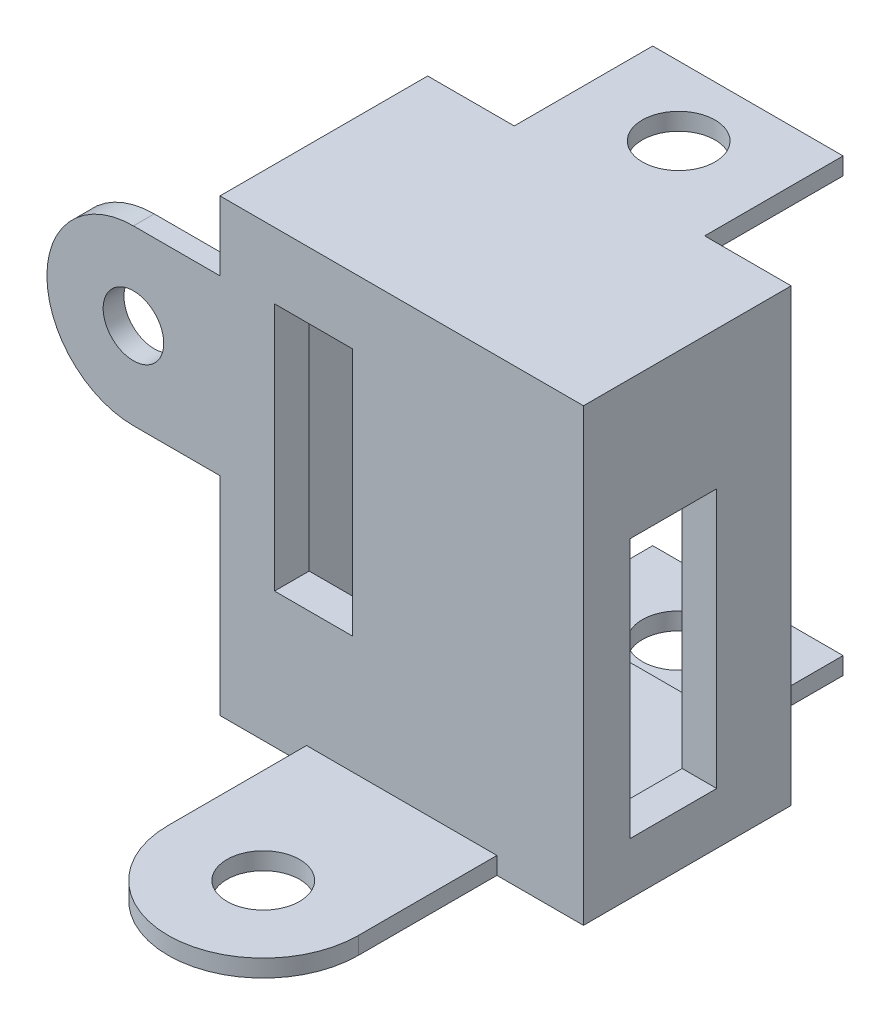
ISO-10303-21;
HEADER;
FILE_DESCRIPTION(('STEP AP214'),'2;1');
FILE_NAME('part.step','',(''),(''),'','','');
FILE_SCHEMA(('AUTOMOTIVE_DESIGN { 1 0 10303 214 1 1 1 1 }'));
ENDSEC;
DATA;
#1=APPLICATION_CONTEXT('core data for automotive mechanical design processes');
#2=APPLICATION_PROTOCOL_DEFINITION('international standard','automotive_design',2000,#1);
#3=PRODUCT_CONTEXT('',#1,'mechanical');
#4=PRODUCT('Part','Part','',(#3));
#5=PRODUCT_RELATED_PRODUCT_CATEGORY('part','',(#4));
#6=PRODUCT_DEFINITION_FORMATION('','',#4);
#7=PRODUCT_DEFINITION_CONTEXT('part definition',#1,'design');
#8=PRODUCT_DEFINITION('design','',#6,#7);
#9=PRODUCT_DEFINITION_SHAPE('','',#8);
#10=(LENGTH_UNIT() NAMED_UNIT(*) SI_UNIT(.MILLI.,.METRE.));
#11=(NAMED_UNIT(*) PLANE_ANGLE_UNIT() SI_UNIT($,.RADIAN.));
#12=(NAMED_UNIT(*) SI_UNIT($,.STERADIAN.) SOLID_ANGLE_UNIT());
#13=UNCERTAINTY_MEASURE_WITH_UNIT(LENGTH_MEASURE(1.E-05),#10,'distance_accuracy_value','');
#14=(GEOMETRIC_REPRESENTATION_CONTEXT(3) GLOBAL_UNCERTAINTY_ASSIGNED_CONTEXT((#13)) GLOBAL_UNIT_ASSIGNED_CONTEXT((#10,
#11,#12)) REPRESENTATION_CONTEXT('',''));
#15=CARTESIAN_POINT('',(0.,0.,0.));
#16=DIRECTION('',(0.,0.,1.));
#17=DIRECTION('',(1.,0.,0.));
#18=AXIS2_PLACEMENT_3D('',#15,#16,#17);
#19=CARTESIAN_POINT('',(0.,0.,12.));
#20=DIRECTION('',(0.,0.,-1.));
#21=DIRECTION('',(-1.,0.,0.));
#22=AXIS2_PLACEMENT_3D('',#19,#20,#21);
#23=PLANE('',#22);
#24=DIRECTION('',(1.,0.,0.));
#25=VECTOR('',#24,1.);
#26=CARTESIAN_POINT('',(0.,9.17624256455344,12.));
#27=LINE('',#26,#25);
#28=CARTESIAN_POINT('',(-7.34922345286043,9.17624256455344,12.));
#29=VERTEX_POINT('',#28);
#30=CARTESIAN_POINT('',(-2.85081475530487,9.17624256455344,12.));
#31=VERTEX_POINT('',#30);
#32=EDGE_CURVE('E279',#29,#31,#27,.T.);
#33=ORIENTED_EDGE('',*,*,#32,.T.);
#34=DIRECTION('',(0.,-1.,0.));
#35=VECTOR('',#34,1.);
#36=CARTESIAN_POINT('',(-2.85081475530487,0.,12.));
#37=LINE('',#36,#35);
#38=CARTESIAN_POINT('',(-2.85081475530487,-5.19672181056315,12.));
#39=VERTEX_POINT('',#38);
#40=EDGE_CURVE('E282',#31,#39,#37,.T.);
#41=ORIENTED_EDGE('',*,*,#40,.T.);
#42=DIRECTION('',(-1.,0.,0.));
#43=VECTOR('',#42,1.);
#44=CARTESIAN_POINT('',(0.,-5.19672181056315,12.));
#45=LINE('',#44,#43);
#46=CARTESIAN_POINT('',(-7.34922345286043,-5.19672181056315,12.));
#47=VERTEX_POINT('',#46);
#48=EDGE_CURVE('E274',#39,#47,#45,.T.);
#49=ORIENTED_EDGE('',*,*,#48,.T.);
#50=DIRECTION('',(0.,1.,0.));
#51=VECTOR('',#50,1.);
#52=CARTESIAN_POINT('',(-7.34922345286043,0.,12.));
#53=LINE('',#52,#51);
#54=EDGE_CURVE('E254',#47,#29,#53,.T.);
#55=ORIENTED_EDGE('',*,*,#54,.T.);
#56=EDGE_LOOP('',(#33,#41,#49,#55));
#57=FACE_BOUND('',#56,.T.);
#58=CARTESIAN_POINT('',(-15.5,4.,12.));
#59=DIRECTION('',(0.,0.,1.));
#60=DIRECTION('',(1.,0.,0.));
#61=AXIS2_PLACEMENT_3D('',#58,#59,#60);
#62=CIRCLE('',#61,1.75);
#63=CARTESIAN_POINT('',(-13.75,4.,12.));
#64=VERTEX_POINT('',#63);
#65=EDGE_CURVE('E315',#64,#64,#62,.T.);
#66=ORIENTED_EDGE('',*,*,#65,.F.);
#67=EDGE_LOOP('',(#66));
#68=FACE_BOUND('',#67,.T.);
#69=DIRECTION('',(0.,-1.,0.));
#70=VECTOR('',#69,1.);
#71=CARTESIAN_POINT('',(-5.5,-12.,12.));
#72=LINE('',#71,#70);
#73=CARTESIAN_POINT('',(-5.5,-12.,12.));
#74=VERTEX_POINT('',#73);
#75=CARTESIAN_POINT('',(-5.5,-13.,12.));
#76=VERTEX_POINT('',#75);
#77=EDGE_CURVE('E313',#74,#76,#72,.T.);
#78=ORIENTED_EDGE('',*,*,#77,.F.);
#79=DIRECTION('',(1.,0.,0.));
#80=VECTOR('',#79,1.);
#81=CARTESIAN_POINT('',(0.,-12.,12.));
#82=LINE('',#81,#80);
#83=CARTESIAN_POINT('',(5.5,-12.,12.));
#84=VERTEX_POINT('',#83);
#85=EDGE_CURVE('E292',#74,#84,#82,.T.);
#86=ORIENTED_EDGE('',*,*,#85,.T.);
#87=DIRECTION('',(0.,-1.,0.));
#88=VECTOR('',#87,1.);
#89=CARTESIAN_POINT('',(5.5,-12.,12.));
#90=LINE('',#89,#88);
#91=CARTESIAN_POINT('',(5.5,-13.,12.));
#92=VERTEX_POINT('',#91);
#93=EDGE_CURVE('E305',#84,#92,#90,.T.);
#94=ORIENTED_EDGE('',*,*,#93,.T.);
#95=DIRECTION('',(1.,0.,0.));
#96=VECTOR('',#95,1.);
#97=CARTESIAN_POINT('',(-10.5,-13.,12.));
#98=LINE('',#97,#96);
#99=CARTESIAN_POINT('',(10.5,-13.,12.));
#100=VERTEX_POINT('',#99);
#101=EDGE_CURVE('E459',#92,#100,#98,.T.);
#102=ORIENTED_EDGE('',*,*,#101,.T.);
#103=DIRECTION('',(0.,1.,0.));
#104=VECTOR('',#103,1.);
#105=CARTESIAN_POINT('',(10.5,-13.,12.));
#106=LINE('',#105,#104);
#107=CARTESIAN_POINT('',(10.5,13.,12.));
#108=VERTEX_POINT('',#107);
#109=EDGE_CURVE('E444',#100,#108,#106,.T.);
#110=ORIENTED_EDGE('',*,*,#109,.T.);
#111=DIRECTION('',(-1.,0.,0.));
#112=VECTOR('',#111,1.);
#113=CARTESIAN_POINT('',(-10.5,13.,12.));
#114=LINE('',#113,#112);
#115=CARTESIAN_POINT('',(-10.5,13.,12.));
#116=VERTEX_POINT('',#115);
#117=EDGE_CURVE('E453',#108,#116,#114,.T.);
#118=ORIENTED_EDGE('',*,*,#117,.T.);
#119=DIRECTION('',(0.,-1.,0.));
#120=VECTOR('',#119,1.);
#121=CARTESIAN_POINT('',(-10.5,-13.,12.));
#122=LINE('',#121,#120);
#123=CARTESIAN_POINT('',(-10.5,9.,12.));
#124=VERTEX_POINT('',#123);
#125=EDGE_CURVE('E456',#116,#124,#122,.T.);
#126=ORIENTED_EDGE('',*,*,#125,.T.);
#127=DIRECTION('',(-1.,0.,0.));
#128=VECTOR('',#127,1.);
#129=CARTESIAN_POINT('',(0.,9.,12.));
#130=LINE('',#129,#128);
#131=CARTESIAN_POINT('',(-15.5,9.,12.));
#132=VERTEX_POINT('',#131);
#133=EDGE_CURVE('E326',#124,#132,#130,.T.);
#134=ORIENTED_EDGE('',*,*,#133,.T.);
#135=CARTESIAN_POINT('',(-15.5,4.,12.));
#136=DIRECTION('',(0.,0.,1.));
#137=DIRECTION('',(1.,0.,0.));
#138=AXIS2_PLACEMENT_3D('',#135,#136,#137);
#139=CIRCLE('',#138,5.);
#140=CARTESIAN_POINT('',(-15.5,-1.,12.));
#141=VERTEX_POINT('',#140);
#142=EDGE_CURVE('E338',#141,#132,#139,.F.);
#143=ORIENTED_EDGE('',*,*,#142,.F.);
#144=DIRECTION('',(-1.,0.,0.));
#145=VECTOR('',#144,1.);
#146=CARTESIAN_POINT('',(0.,-1.,12.));
#147=LINE('',#146,#145);
#148=CARTESIAN_POINT('',(-10.5,-1.,12.));
#149=VERTEX_POINT('',#148);
#150=EDGE_CURVE('E341',#149,#141,#147,.T.);
#151=ORIENTED_EDGE('',*,*,#150,.F.);
#152=CARTESIAN_POINT('',(-10.5,-13.,12.));
#153=VERTEX_POINT('',#152);
#154=EDGE_CURVE('E455',#149,#153,#122,.T.);
#155=ORIENTED_EDGE('',*,*,#154,.T.);
#156=EDGE_CURVE('E460',#153,#76,#98,.T.);
#157=ORIENTED_EDGE('',*,*,#156,.T.);
#158=EDGE_LOOP('',(#78,#86,#94,#102,#110,#118,#126,#134,#143,#151,#155,#157));
#159=FACE_BOUND('',#158,.T.);
#160=ADVANCED_FACE('F38',(#57,#68,#159),#23,.F.);
#161=CARTESIAN_POINT('',(-10.5,-13.,10.));
#162=DIRECTION('',(1.,0.,0.));
#163=DIRECTION('',(0.,0.,-1.));
#164=AXIS2_PLACEMENT_3D('',#161,#162,#163);
#165=PLANE('',#164);
#166=DIRECTION('',(0.,0.,1.));
#167=VECTOR('',#166,1.);
#168=CARTESIAN_POINT('',(-10.5,-1.,10.8));
#169=LINE('',#168,#167);
#170=CARTESIAN_POINT('',(-10.5,-1.,10.8));
#171=VERTEX_POINT('',#170);
#172=EDGE_CURVE('E351',#171,#149,#169,.T.);
#173=ORIENTED_EDGE('',*,*,#172,.F.);
#174=DIRECTION('',(0.,-1.,0.));
#175=VECTOR('',#174,1.);
#176=CARTESIAN_POINT('',(-10.5,0.,10.8));
#177=LINE('',#176,#175);
#178=CARTESIAN_POINT('',(-10.5,9.,10.8));
#179=VERTEX_POINT('',#178);
#180=EDGE_CURVE('E330',#179,#171,#177,.T.);
#181=ORIENTED_EDGE('',*,*,#180,.F.);
#182=DIRECTION('',(0.,0.,1.));
#183=VECTOR('',#182,1.);
#184=CARTESIAN_POINT('',(-10.5,9.,10.8));
#185=LINE('',#184,#183);
#186=EDGE_CURVE('E348',#179,#124,#185,.T.);
#187=ORIENTED_EDGE('',*,*,#186,.T.);
#188=ORIENTED_EDGE('',*,*,#125,.F.);
#189=DIRECTION('',(0.,0.,-1.));
#190=VECTOR('',#189,1.);
#191=CARTESIAN_POINT('',(-10.5,13.,10.));
#192=LINE('',#191,#190);
#193=CARTESIAN_POINT('',(-10.5,13.,0.));
#194=VERTEX_POINT('',#193);
#195=EDGE_CURVE('E47',#116,#194,#192,.T.);
#196=ORIENTED_EDGE('',*,*,#195,.T.);
#197=DIRECTION('',(0.,-1.,0.));
#198=VECTOR('',#197,1.);
#199=CARTESIAN_POINT('',(-10.5,-13.,0.));
#200=LINE('',#199,#198);
#201=CARTESIAN_POINT('',(-10.5,-13.,0.));
#202=VERTEX_POINT('',#201);
#203=EDGE_CURVE('E504',#194,#202,#200,.T.);
#204=ORIENTED_EDGE('',*,*,#203,.T.);
#205=DIRECTION('',(0.,0.,-1.));
#206=VECTOR('',#205,1.);
#207=CARTESIAN_POINT('',(-10.5,-13.,10.));
#208=LINE('',#207,#206);
#209=EDGE_CURVE('E513',#153,#202,#208,.T.);
#210=ORIENTED_EDGE('',*,*,#209,.F.);
#211=ORIENTED_EDGE('',*,*,#154,.F.);
#212=EDGE_LOOP('',(#173,#181,#187,#188,#196,#204,#210,#211));
#213=FACE_BOUND('',#212,.T.);
#214=ADVANCED_FACE('F522',(#213),#165,.F.);
#215=CARTESIAN_POINT('',(0.,0.,0.));
#216=DIRECTION('',(0.,0.,-1.));
#217=DIRECTION('',(-1.,0.,0.));
#218=AXIS2_PLACEMENT_3D('',#215,#216,#217);
#219=PLANE('',#218);
#220=DIRECTION('',(1.,0.,0.));
#221=VECTOR('',#220,1.);
#222=CARTESIAN_POINT('',(-8.5,-10.5,0.));
#223=LINE('',#222,#221);
#224=CARTESIAN_POINT('',(-8.5,-10.5,0.));
#225=VERTEX_POINT('',#224);
#226=CARTESIAN_POINT('',(8.5,-10.5,0.));
#227=VERTEX_POINT('',#226);
#228=EDGE_CURVE('E468',#225,#227,#223,.T.);
#229=ORIENTED_EDGE('',*,*,#228,.T.);
#230=DIRECTION('',(0.,1.,0.));
#231=VECTOR('',#230,1.);
#232=CARTESIAN_POINT('',(8.5,-10.5,0.));
#233=LINE('',#232,#231);
#234=CARTESIAN_POINT('',(8.5,10.5,0.));
#235=VERTEX_POINT('',#234);
#236=EDGE_CURVE('E463',#227,#235,#233,.T.);
#237=ORIENTED_EDGE('',*,*,#236,.T.);
#238=DIRECTION('',(-1.,0.,0.));
#239=VECTOR('',#238,1.);
#240=CARTESIAN_POINT('',(-8.5,10.5,0.));
#241=LINE('',#240,#239);
#242=CARTESIAN_POINT('',(-8.5,10.5,0.));
#243=VERTEX_POINT('',#242);
#244=EDGE_CURVE('E480',#235,#243,#241,.T.);
#245=ORIENTED_EDGE('',*,*,#244,.T.);
#246=DIRECTION('',(0.,-1.,0.));
#247=VECTOR('',#246,1.);
#248=CARTESIAN_POINT('',(-8.5,-10.5,0.));
#249=LINE('',#248,#247);
#250=EDGE_CURVE('E483',#243,#225,#249,.T.);
#251=ORIENTED_EDGE('',*,*,#250,.T.);
#252=EDGE_LOOP('',(#229,#237,#245,#251));
#253=FACE_BOUND('',#252,.T.);
#254=DIRECTION('',(-1.,0.,0.));
#255=VECTOR('',#254,1.);
#256=CARTESIAN_POINT('',(-5.5,12.,0.));
#257=LINE('',#256,#255);
#258=CARTESIAN_POINT('',(5.5,12.,0.));
#259=VERTEX_POINT('',#258);
#260=CARTESIAN_POINT('',(-5.5,12.,0.));
#261=VERTEX_POINT('',#260);
#262=EDGE_CURVE('E377',#259,#261,#257,.T.);
#263=ORIENTED_EDGE('',*,*,#262,.F.);
#264=DIRECTION('',(0.,-1.,0.));
#265=VECTOR('',#264,1.);
#266=CARTESIAN_POINT('',(5.5,12.,0.));
#267=LINE('',#266,#265);
#268=CARTESIAN_POINT('',(5.5,13.,0.));
#269=VERTEX_POINT('',#268);
#270=EDGE_CURVE('E363',#269,#259,#267,.T.);
#271=ORIENTED_EDGE('',*,*,#270,.F.);
#272=DIRECTION('',(-1.,0.,0.));
#273=VECTOR('',#272,1.);
#274=CARTESIAN_POINT('',(-10.5,13.,0.));
#275=LINE('',#274,#273);
#276=CARTESIAN_POINT('',(10.5,13.,0.));
#277=VERTEX_POINT('',#276);
#278=EDGE_CURVE('E501',#277,#269,#275,.T.);
#279=ORIENTED_EDGE('',*,*,#278,.F.);
#280=DIRECTION('',(0.,1.,0.));
#281=VECTOR('',#280,1.);
#282=CARTESIAN_POINT('',(10.5,-13.,0.));
#283=LINE('',#282,#281);
#284=CARTESIAN_POINT('',(10.5,-13.,0.));
#285=VERTEX_POINT('',#284);
#286=EDGE_CURVE('E497',#285,#277,#283,.T.);
#287=ORIENTED_EDGE('',*,*,#286,.F.);
#288=DIRECTION('',(1.,0.,0.));
#289=VECTOR('',#288,1.);
#290=CARTESIAN_POINT('',(-10.5,-13.,0.));
#291=LINE('',#290,#289);
#292=CARTESIAN_POINT('',(5.49999999999999,-13.,0.));
#293=VERTEX_POINT('',#292);
#294=EDGE_CURVE('E506',#293,#285,#291,.T.);
#295=ORIENTED_EDGE('',*,*,#294,.F.);
#296=DIRECTION('',(0.,-1.,0.));
#297=VECTOR('',#296,1.);
#298=CARTESIAN_POINT('',(5.5,-12.,0.));
#299=LINE('',#298,#297);
#300=CARTESIAN_POINT('',(5.5,-12.,0.));
#301=VERTEX_POINT('',#300);
#302=EDGE_CURVE('E389',#301,#293,#299,.T.);
#303=ORIENTED_EDGE('',*,*,#302,.F.);
#304=DIRECTION('',(1.,0.,0.));
#305=VECTOR('',#304,1.);
#306=CARTESIAN_POINT('',(-5.5,-12.,0.));
#307=LINE('',#306,#305);
#308=CARTESIAN_POINT('',(-5.5,-12.,0.));
#309=VERTEX_POINT('',#308);
#310=EDGE_CURVE('E394',#309,#301,#307,.T.);
#311=ORIENTED_EDGE('',*,*,#310,.F.);
#312=DIRECTION('',(0.,1.,0.));
#313=VECTOR('',#312,1.);
#314=CARTESIAN_POINT('',(-5.5,-13.,0.));
#315=LINE('',#314,#313);
#316=CARTESIAN_POINT('',(-5.5,-13.,0.));
#317=VERTEX_POINT('',#316);
#318=EDGE_CURVE('E403',#317,#309,#315,.T.);
#319=ORIENTED_EDGE('',*,*,#318,.F.);
#320=EDGE_CURVE('E507',#202,#317,#291,.T.);
#321=ORIENTED_EDGE('',*,*,#320,.F.);
#322=ORIENTED_EDGE('',*,*,#203,.F.);
#323=CARTESIAN_POINT('',(-5.5,13.,0.));
#324=VERTEX_POINT('',#323);
#325=EDGE_CURVE('E500',#324,#194,#275,.T.);
#326=ORIENTED_EDGE('',*,*,#325,.F.);
#327=DIRECTION('',(0.,1.,0.));
#328=VECTOR('',#327,1.);
#329=CARTESIAN_POINT('',(-5.5,13.,0.));
#330=LINE('',#329,#328);
#331=EDGE_CURVE('E368',#261,#324,#330,.T.);
#332=ORIENTED_EDGE('',*,*,#331,.F.);
#333=EDGE_LOOP('',(#263,#271,#279,#287,#295,#303,#311,#319,#321,#322,#326,#332));
#334=FACE_BOUND('',#333,.T.);
#335=ADVANCED_FACE('F530',(#253,#334),#219,.T.);
#336=CARTESIAN_POINT('',(-10.5,-13.,10.));
#337=DIRECTION('',(0.,1.,0.));
#338=DIRECTION('',(0.,0.,1.));
#339=AXIS2_PLACEMENT_3D('',#336,#337,#338);
#340=PLANE('',#339);
#341=DIRECTION('',(0.,0.,-1.));
#342=VECTOR('',#341,1.);
#343=CARTESIAN_POINT('',(10.5,-13.,10.));
#344=LINE('',#343,#342);
#345=EDGE_CURVE('E510',#100,#285,#344,.T.);
#346=ORIENTED_EDGE('',*,*,#345,.F.);
#347=ORIENTED_EDGE('',*,*,#101,.F.);
#348=DIRECTION('',(0.,0.,1.));
#349=VECTOR('',#348,1.);
#350=CARTESIAN_POINT('',(5.5,-13.,12.));
#351=LINE('',#350,#349);
#352=CARTESIAN_POINT('',(5.5,-13.,20.));
#353=VERTEX_POINT('',#352);
#354=EDGE_CURVE('E289',#92,#353,#351,.T.);
#355=ORIENTED_EDGE('',*,*,#354,.T.);
#356=CARTESIAN_POINT('',(0.,-13.,20.));
#357=DIRECTION('',(0.,-1.,0.));
#358=DIRECTION('',(0.,0.,-1.));
#359=AXIS2_PLACEMENT_3D('',#356,#357,#358);
#360=CIRCLE('',#359,5.5);
#361=CARTESIAN_POINT('',(-5.5,-13.,20.));
#362=VERTEX_POINT('',#361);
#363=EDGE_CURVE('E308',#353,#362,#360,.T.);
#364=ORIENTED_EDGE('',*,*,#363,.T.);
#365=DIRECTION('',(0.,0.,-1.));
#366=VECTOR('',#365,1.);
#367=CARTESIAN_POINT('',(-5.5,-13.,12.));
#368=LINE('',#367,#366);
#369=EDGE_CURVE('E296',#362,#76,#368,.T.);
#370=ORIENTED_EDGE('',*,*,#369,.T.);
#371=ORIENTED_EDGE('',*,*,#156,.F.);
#372=ORIENTED_EDGE('',*,*,#209,.T.);
#373=ORIENTED_EDGE('',*,*,#320,.T.);
#374=DIRECTION('',(0.,0.,1.));
#375=VECTOR('',#374,1.);
#376=CARTESIAN_POINT('',(-5.5,-13.,-8.));
#377=LINE('',#376,#375);
#378=CARTESIAN_POINT('',(-5.5,-13.,-8.));
#379=VERTEX_POINT('',#378);
#380=EDGE_CURVE('E413',#379,#317,#377,.T.);
#381=ORIENTED_EDGE('',*,*,#380,.F.);
#382=DIRECTION('',(-1.,0.,0.));
#383=VECTOR('',#382,1.);
#384=CARTESIAN_POINT('',(5.5,-13.,-8.));
#385=LINE('',#384,#383);
#386=CARTESIAN_POINT('',(5.5,-13.,-8.));
#387=VERTEX_POINT('',#386);
#388=EDGE_CURVE('E393',#387,#379,#385,.T.);
#389=ORIENTED_EDGE('',*,*,#388,.F.);
#390=DIRECTION('',(0.,0.,1.));
#391=VECTOR('',#390,1.);
#392=CARTESIAN_POINT('',(5.5,-13.,-8.));
#393=LINE('',#392,#391);
#394=EDGE_CURVE('E416',#387,#293,#393,.T.);
#395=ORIENTED_EDGE('',*,*,#394,.T.);
#396=ORIENTED_EDGE('',*,*,#294,.T.);
#397=EDGE_LOOP('',(#346,#347,#355,#364,#370,#371,#372,#373,#381,#389,#395,#396));
#398=FACE_BOUND('',#397,.T.);
#399=CARTESIAN_POINT('',(0.,-13.,-4.));
#400=DIRECTION('',(0.,1.,0.));
#401=DIRECTION('',(0.,0.,1.));
#402=AXIS2_PLACEMENT_3D('',#399,#400,#401);
#403=CIRCLE('',#402,2.1);
#404=CARTESIAN_POINT('',(0.,-13.,-1.9));
#405=VERTEX_POINT('',#404);
#406=EDGE_CURVE('E360',#405,#405,#403,.T.);
#407=ORIENTED_EDGE('',*,*,#406,.T.);
#408=EDGE_LOOP('',(#407));
#409=FACE_BOUND('',#408,.T.);
#410=CARTESIAN_POINT('',(0.,-13.,20.));
#411=DIRECTION('',(0.,-1.,0.));
#412=DIRECTION('',(0.,0.,-1.));
#413=AXIS2_PLACEMENT_3D('',#410,#411,#412);
#414=CIRCLE('',#413,2.1);
#415=CARTESIAN_POINT('',(0.,-13.,17.9));
#416=VERTEX_POINT('',#415);
#417=EDGE_CURVE('E285',#416,#416,#414,.T.);
#418=ORIENTED_EDGE('',*,*,#417,.F.);
#419=EDGE_LOOP('',(#418));
#420=FACE_BOUND('',#419,.T.);
#421=ADVANCED_FACE('F535',(#398,#409,#420),#340,.F.);
#422=CARTESIAN_POINT('',(-10.5,13.,10.));
#423=DIRECTION('',(0.,-1.,0.));
#424=DIRECTION('',(0.,0.,-1.));
#425=AXIS2_PLACEMENT_3D('',#422,#423,#424);
#426=PLANE('',#425);
#427=ORIENTED_EDGE('',*,*,#195,.F.);
#428=ORIENTED_EDGE('',*,*,#117,.F.);
#429=DIRECTION('',(0.,0.,-1.));
#430=VECTOR('',#429,1.);
#431=CARTESIAN_POINT('',(10.5,13.,10.));
#432=LINE('',#431,#430);
#433=EDGE_CURVE('E11',#108,#277,#432,.T.);
#434=ORIENTED_EDGE('',*,*,#433,.T.);
#435=ORIENTED_EDGE('',*,*,#278,.T.);
#436=DIRECTION('',(0.,0.,1.));
#437=VECTOR('',#436,1.);
#438=CARTESIAN_POINT('',(5.5,13.,-8.));
#439=LINE('',#438,#437);
#440=CARTESIAN_POINT('',(5.5,13.,-8.));
#441=VERTEX_POINT('',#440);
#442=EDGE_CURVE('E374',#441,#269,#439,.T.);
#443=ORIENTED_EDGE('',*,*,#442,.F.);
#444=DIRECTION('',(1.,0.,0.));
#445=VECTOR('',#444,1.);
#446=CARTESIAN_POINT('',(5.5,13.,-8.));
#447=LINE('',#446,#445);
#448=CARTESIAN_POINT('',(-5.5,13.,-8.));
#449=VERTEX_POINT('',#448);
#450=EDGE_CURVE('E372',#449,#441,#447,.T.);
#451=ORIENTED_EDGE('',*,*,#450,.F.);
#452=DIRECTION('',(0.,0.,1.));
#453=VECTOR('',#452,1.);
#454=CARTESIAN_POINT('',(-5.5,13.,-8.));
#455=LINE('',#454,#453);
#456=EDGE_CURVE('E382',#449,#324,#455,.T.);
#457=ORIENTED_EDGE('',*,*,#456,.T.);
#458=ORIENTED_EDGE('',*,*,#325,.T.);
#459=EDGE_LOOP('',(#427,#428,#434,#435,#443,#451,#457,#458));
#460=FACE_BOUND('',#459,.T.);
#461=CARTESIAN_POINT('',(0.,13.,-4.));
#462=DIRECTION('',(0.,1.,0.));
#463=DIRECTION('',(0.,0.,1.));
#464=AXIS2_PLACEMENT_3D('',#461,#462,#463);
#465=CIRCLE('',#464,2.1);
#466=CARTESIAN_POINT('',(0.,13.,-1.9));
#467=VERTEX_POINT('',#466);
#468=EDGE_CURVE('E347',#467,#467,#465,.T.);
#469=ORIENTED_EDGE('',*,*,#468,.F.);
#470=EDGE_LOOP('',(#469));
#471=FACE_BOUND('',#470,.T.);
#472=ADVANCED_FACE('F597',(#460,#471),#426,.F.);
#473=CARTESIAN_POINT('',(10.5,-13.,10.));
#474=DIRECTION('',(-1.,0.,0.));
#475=DIRECTION('',(0.,0.,1.));
#476=AXIS2_PLACEMENT_3D('',#473,#474,#475);
#477=PLANE('',#476);
#478=ORIENTED_EDGE('',*,*,#286,.T.);
#479=ORIENTED_EDGE('',*,*,#433,.F.);
#480=ORIENTED_EDGE('',*,*,#109,.F.);
#481=ORIENTED_EDGE('',*,*,#345,.T.);
#482=EDGE_LOOP('',(#478,#479,#480,#481));
#483=FACE_BOUND('',#482,.T.);
#484=DIRECTION('',(0.,0.,-1.));
#485=VECTOR('',#484,1.);
#486=CARTESIAN_POINT('',(10.5,5.,0.));
#487=LINE('',#486,#485);
#488=CARTESIAN_POINT('',(10.5,5.,9.3));
#489=VERTEX_POINT('',#488);
#490=CARTESIAN_POINT('',(10.5,5.,4.3));
#491=VERTEX_POINT('',#490);
#492=EDGE_CURVE('E419',#489,#491,#487,.T.);
#493=ORIENTED_EDGE('',*,*,#492,.T.);
#494=DIRECTION('',(0.,-1.,0.));
#495=VECTOR('',#494,1.);
#496=CARTESIAN_POINT('',(10.5,0.,4.3));
#497=LINE('',#496,#495);
#498=CARTESIAN_POINT('',(10.5,-10.,4.3));
#499=VERTEX_POINT('',#498);
#500=EDGE_CURVE('E423',#491,#499,#497,.T.);
#501=ORIENTED_EDGE('',*,*,#500,.T.);
#502=DIRECTION('',(0.,0.,1.));
#503=VECTOR('',#502,1.);
#504=CARTESIAN_POINT('',(10.5,-10.,0.));
#505=LINE('',#504,#503);
#506=CARTESIAN_POINT('',(10.5,-10.,9.3));
#507=VERTEX_POINT('',#506);
#508=EDGE_CURVE('E436',#499,#507,#505,.T.);
#509=ORIENTED_EDGE('',*,*,#508,.T.);
#510=DIRECTION('',(0.,1.,0.));
#511=VECTOR('',#510,1.);
#512=CARTESIAN_POINT('',(10.5,0.,9.3));
#513=LINE('',#512,#511);
#514=EDGE_CURVE('E433',#507,#489,#513,.T.);
#515=ORIENTED_EDGE('',*,*,#514,.T.);
#516=EDGE_LOOP('',(#493,#501,#509,#515));
#517=FACE_BOUND('',#516,.T.);
#518=ADVANCED_FACE('F40',(#483,#517),#477,.F.);
#519=CARTESIAN_POINT('',(8.5,-10.5,10.));
#520=DIRECTION('',(-1.,0.,0.));
#521=DIRECTION('',(0.,0.,1.));
#522=AXIS2_PLACEMENT_3D('',#519,#520,#521);
#523=PLANE('',#522);
#524=ORIENTED_EDGE('',*,*,#236,.F.);
#525=DIRECTION('',(0.,0.,-1.));
#526=VECTOR('',#525,1.);
#527=CARTESIAN_POINT('',(8.5,-10.5,10.));
#528=LINE('',#527,#526);
#529=CARTESIAN_POINT('',(8.5,-10.5,10.));
#530=VERTEX_POINT('',#529);
#531=EDGE_CURVE('E477',#530,#227,#528,.T.);
#532=ORIENTED_EDGE('',*,*,#531,.F.);
#533=DIRECTION('',(0.,1.,0.));
#534=VECTOR('',#533,1.);
#535=CARTESIAN_POINT('',(8.5,-10.5,10.));
#536=LINE('',#535,#534);
#537=CARTESIAN_POINT('',(8.5,10.5,10.));
#538=VERTEX_POINT('',#537);
#539=EDGE_CURVE('E464',#530,#538,#536,.T.);
#540=ORIENTED_EDGE('',*,*,#539,.T.);
#541=DIRECTION('',(0.,0.,-1.));
#542=VECTOR('',#541,1.);
#543=CARTESIAN_POINT('',(8.5,10.5,10.));
#544=LINE('',#543,#542);
#545=EDGE_CURVE('E494',#538,#235,#544,.T.);
#546=ORIENTED_EDGE('',*,*,#545,.T.);
#547=EDGE_LOOP('',(#524,#532,#540,#546));
#548=FACE_BOUND('',#547,.T.);
#549=DIRECTION('',(0.,-1.,0.));
#550=VECTOR('',#549,1.);
#551=CARTESIAN_POINT('',(8.5,0.,4.3));
#552=LINE('',#551,#550);
#553=CARTESIAN_POINT('',(8.5,5.,4.3));
#554=VERTEX_POINT('',#553);
#555=CARTESIAN_POINT('',(8.5,-10.,4.3));
#556=VERTEX_POINT('',#555);
#557=EDGE_CURVE('E428',#554,#556,#552,.T.);
#558=ORIENTED_EDGE('',*,*,#557,.F.);
#559=DIRECTION('',(0.,0.,-1.));
#560=VECTOR('',#559,1.);
#561=CARTESIAN_POINT('',(8.5,5.,0.));
#562=LINE('',#561,#560);
#563=CARTESIAN_POINT('',(8.5,5.,9.3));
#564=VERTEX_POINT('',#563);
#565=EDGE_CURVE('E420',#564,#554,#562,.T.);
#566=ORIENTED_EDGE('',*,*,#565,.F.);
#567=DIRECTION('',(0.,1.,0.));
#568=VECTOR('',#567,1.);
#569=CARTESIAN_POINT('',(8.5,0.,9.3));
#570=LINE('',#569,#568);
#571=CARTESIAN_POINT('',(8.5,-10.,9.3));
#572=VERTEX_POINT('',#571);
#573=EDGE_CURVE('E422',#572,#564,#570,.T.);
#574=ORIENTED_EDGE('',*,*,#573,.F.);
#575=DIRECTION('',(0.,0.,1.));
#576=VECTOR('',#575,1.);
#577=CARTESIAN_POINT('',(8.5,-10.,0.));
#578=LINE('',#577,#576);
#579=EDGE_CURVE('E425',#556,#572,#578,.T.);
#580=ORIENTED_EDGE('',*,*,#579,.F.);
#581=EDGE_LOOP('',(#558,#566,#574,#580));
#582=FACE_BOUND('',#581,.T.);
#583=ADVANCED_FACE('F588',(#548,#582),#523,.T.);
#584=CARTESIAN_POINT('',(-8.5,10.5,10.));
#585=DIRECTION('',(0.,-1.,0.));
#586=DIRECTION('',(0.,0.,-1.));
#587=AXIS2_PLACEMENT_3D('',#584,#585,#586);
#588=PLANE('',#587);
#589=ORIENTED_EDGE('',*,*,#244,.F.);
#590=ORIENTED_EDGE('',*,*,#545,.F.);
#591=DIRECTION('',(-1.,0.,0.));
#592=VECTOR('',#591,1.);
#593=CARTESIAN_POINT('',(-8.5,10.5,10.));
#594=LINE('',#593,#592);
#595=CARTESIAN_POINT('',(-8.5,10.5,10.));
#596=VERTEX_POINT('',#595);
#597=EDGE_CURVE('E467',#538,#596,#594,.T.);
#598=ORIENTED_EDGE('',*,*,#597,.T.);
#599=DIRECTION('',(0.,0.,-1.));
#600=VECTOR('',#599,1.);
#601=CARTESIAN_POINT('',(-8.5,10.5,10.));
#602=LINE('',#601,#600);
#603=EDGE_CURVE('E492',#596,#243,#602,.T.);
#604=ORIENTED_EDGE('',*,*,#603,.T.);
#605=EDGE_LOOP('',(#589,#590,#598,#604));
#606=FACE_BOUND('',#605,.T.);
#607=ADVANCED_FACE('F584',(#606),#588,.T.);
#608=CARTESIAN_POINT('',(-8.5,-10.5,10.));
#609=DIRECTION('',(1.,0.,0.));
#610=DIRECTION('',(0.,0.,-1.));
#611=AXIS2_PLACEMENT_3D('',#608,#609,#610);
#612=PLANE('',#611);
#613=ORIENTED_EDGE('',*,*,#250,.F.);
#614=ORIENTED_EDGE('',*,*,#603,.F.);
#615=DIRECTION('',(0.,-1.,0.));
#616=VECTOR('',#615,1.);
#617=CARTESIAN_POINT('',(-8.5,-10.5,10.));
#618=LINE('',#617,#616);
#619=CARTESIAN_POINT('',(-8.5,-10.5,10.));
#620=VERTEX_POINT('',#619);
#621=EDGE_CURVE('E471',#596,#620,#618,.T.);
#622=ORIENTED_EDGE('',*,*,#621,.T.);
#623=DIRECTION('',(0.,0.,-1.));
#624=VECTOR('',#623,1.);
#625=CARTESIAN_POINT('',(-8.5,-10.5,10.));
#626=LINE('',#625,#624);
#627=EDGE_CURVE('E490',#620,#225,#626,.T.);
#628=ORIENTED_EDGE('',*,*,#627,.T.);
#629=EDGE_LOOP('',(#613,#614,#622,#628));
#630=FACE_BOUND('',#629,.T.);
#631=ADVANCED_FACE('F580',(#630),#612,.T.);
#632=CARTESIAN_POINT('',(-8.5,-10.5,10.));
#633=DIRECTION('',(0.,1.,0.));
#634=DIRECTION('',(0.,0.,1.));
#635=AXIS2_PLACEMENT_3D('',#632,#633,#634);
#636=PLANE('',#635);
#637=ORIENTED_EDGE('',*,*,#228,.F.);
#638=ORIENTED_EDGE('',*,*,#627,.F.);
#639=DIRECTION('',(1.,0.,0.));
#640=VECTOR('',#639,1.);
#641=CARTESIAN_POINT('',(-8.5,-10.5,10.));
#642=LINE('',#641,#640);
#643=EDGE_CURVE('E474',#620,#530,#642,.T.);
#644=ORIENTED_EDGE('',*,*,#643,.T.);
#645=ORIENTED_EDGE('',*,*,#531,.T.);
#646=EDGE_LOOP('',(#637,#638,#644,#645));
#647=FACE_BOUND('',#646,.T.);
#648=ADVANCED_FACE('F577',(#647),#636,.T.);
#649=CARTESIAN_POINT('',(0.,0.,10.));
#650=DIRECTION('',(0.,0.,-1.));
#651=DIRECTION('',(-1.,0.,0.));
#652=AXIS2_PLACEMENT_3D('',#649,#650,#651);
#653=PLANE('',#652);
#654=DIRECTION('',(0.,-1.,0.));
#655=VECTOR('',#654,1.);
#656=CARTESIAN_POINT('',(-2.85081475530487,9.17624256455344,10.));
#657=LINE('',#656,#655);
#658=CARTESIAN_POINT('',(-2.85081475530487,9.17624256455344,10.));
#659=VERTEX_POINT('',#658);
#660=CARTESIAN_POINT('',(-2.85081475530487,-5.19672181056315,10.));
#661=VERTEX_POINT('',#660);
#662=EDGE_CURVE('E62',#659,#661,#657,.T.);
#663=ORIENTED_EDGE('',*,*,#662,.F.);
#664=DIRECTION('',(1.,0.,0.));
#665=VECTOR('',#664,1.);
#666=CARTESIAN_POINT('',(-2.85081475530487,9.17624256455344,10.));
#667=LINE('',#666,#665);
#668=CARTESIAN_POINT('',(-7.34922345286043,9.17624256455344,10.));
#669=VERTEX_POINT('',#668);
#670=EDGE_CURVE('E267',#669,#659,#667,.T.);
#671=ORIENTED_EDGE('',*,*,#670,.F.);
#672=DIRECTION('',(0.,1.,0.));
#673=VECTOR('',#672,1.);
#674=CARTESIAN_POINT('',(-7.34922345286043,9.17624256455344,10.));
#675=LINE('',#674,#673);
#676=CARTESIAN_POINT('',(-7.34922345286043,-5.19672181056315,10.));
#677=VERTEX_POINT('',#676);
#678=EDGE_CURVE('E251',#677,#669,#675,.T.);
#679=ORIENTED_EDGE('',*,*,#678,.F.);
#680=DIRECTION('',(-1.,0.,0.));
#681=VECTOR('',#680,1.);
#682=CARTESIAN_POINT('',(-2.85081475530487,-5.19672181056315,10.));
#683=LINE('',#682,#681);
#684=EDGE_CURVE('E260',#661,#677,#683,.T.);
#685=ORIENTED_EDGE('',*,*,#684,.F.);
#686=EDGE_LOOP('',(#663,#671,#679,#685));
#687=FACE_BOUND('',#686,.T.);
#688=ORIENTED_EDGE('',*,*,#539,.F.);
#689=ORIENTED_EDGE('',*,*,#643,.F.);
#690=ORIENTED_EDGE('',*,*,#621,.F.);
#691=ORIENTED_EDGE('',*,*,#597,.F.);
#692=EDGE_LOOP('',(#688,#689,#690,#691));
#693=FACE_BOUND('',#692,.T.);
#694=ADVANCED_FACE('F264',(#687,#693),#653,.T.);
#695=CARTESIAN_POINT('',(8.5,5.,0.));
#696=DIRECTION('',(0.,-1.,0.));
#697=DIRECTION('',(0.,0.,-1.));
#698=AXIS2_PLACEMENT_3D('',#695,#696,#697);
#699=PLANE('',#698);
#700=ORIENTED_EDGE('',*,*,#492,.F.);
#701=DIRECTION('',(1.,0.,0.));
#702=VECTOR('',#701,1.);
#703=CARTESIAN_POINT('',(8.5,5.,9.3));
#704=LINE('',#703,#702);
#705=EDGE_CURVE('E430',#564,#489,#704,.T.);
#706=ORIENTED_EDGE('',*,*,#705,.F.);
#707=ORIENTED_EDGE('',*,*,#565,.T.);
#708=DIRECTION('',(1.,0.,0.));
#709=VECTOR('',#708,1.);
#710=CARTESIAN_POINT('',(8.5,5.,4.3));
#711=LINE('',#710,#709);
#712=EDGE_CURVE('E441',#554,#491,#711,.T.);
#713=ORIENTED_EDGE('',*,*,#712,.T.);
#714=EDGE_LOOP('',(#700,#706,#707,#713));
#715=FACE_BOUND('',#714,.T.);
#716=ADVANCED_FACE('F573',(#715),#699,.T.);
#717=CARTESIAN_POINT('',(8.5,0.,4.3));
#718=DIRECTION('',(0.,0.,1.));
#719=DIRECTION('',(0.,-1.,0.));
#720=AXIS2_PLACEMENT_3D('',#717,#718,#719);
#721=PLANE('',#720);
#722=ORIENTED_EDGE('',*,*,#500,.F.);
#723=ORIENTED_EDGE('',*,*,#712,.F.);
#724=ORIENTED_EDGE('',*,*,#557,.T.);
#725=DIRECTION('',(1.,0.,0.));
#726=VECTOR('',#725,1.);
#727=CARTESIAN_POINT('',(8.5,-10.,4.3));
#728=LINE('',#727,#726);
#729=EDGE_CURVE('E445',#556,#499,#728,.T.);
#730=ORIENTED_EDGE('',*,*,#729,.T.);
#731=EDGE_LOOP('',(#722,#723,#724,#730));
#732=FACE_BOUND('',#731,.T.);
#733=ADVANCED_FACE('F862',(#732),#721,.T.);
#734=CARTESIAN_POINT('',(8.5,-10.,0.));
#735=DIRECTION('',(0.,1.,0.));
#736=DIRECTION('',(0.,0.,1.));
#737=AXIS2_PLACEMENT_3D('',#734,#735,#736);
#738=PLANE('',#737);
#739=ORIENTED_EDGE('',*,*,#508,.F.);
#740=ORIENTED_EDGE('',*,*,#729,.F.);
#741=ORIENTED_EDGE('',*,*,#579,.T.);
#742=DIRECTION('',(1.,0.,0.));
#743=VECTOR('',#742,1.);
#744=CARTESIAN_POINT('',(8.5,-10.,9.3));
#745=LINE('',#744,#743);
#746=EDGE_CURVE('E447',#572,#507,#745,.T.);
#747=ORIENTED_EDGE('',*,*,#746,.T.);
#748=EDGE_LOOP('',(#739,#740,#741,#747));
#749=FACE_BOUND('',#748,.T.);
#750=ADVANCED_FACE('F870',(#749),#738,.T.);
#751=CARTESIAN_POINT('',(8.5,0.,9.3));
#752=DIRECTION('',(0.,0.,-1.));
#753=DIRECTION('',(0.,1.,0.));
#754=AXIS2_PLACEMENT_3D('',#751,#752,#753);
#755=PLANE('',#754);
#756=ORIENTED_EDGE('',*,*,#514,.F.);
#757=ORIENTED_EDGE('',*,*,#746,.F.);
#758=ORIENTED_EDGE('',*,*,#573,.T.);
#759=ORIENTED_EDGE('',*,*,#705,.T.);
#760=EDGE_LOOP('',(#756,#757,#758,#759));
#761=FACE_BOUND('',#760,.T.);
#762=ADVANCED_FACE('F878',(#761),#755,.T.);
#763=CARTESIAN_POINT('',(5.5,-12.,-8.));
#764=DIRECTION('',(-1.,0.,0.));
#765=DIRECTION('',(0.,0.,1.));
#766=AXIS2_PLACEMENT_3D('',#763,#764,#765);
#767=PLANE('',#766);
#768=ORIENTED_EDGE('',*,*,#302,.T.);
#769=ORIENTED_EDGE('',*,*,#394,.F.);
#770=DIRECTION('',(0.,-1.,0.));
#771=VECTOR('',#770,1.);
#772=CARTESIAN_POINT('',(5.5,-12.,-8.));
#773=LINE('',#772,#771);
#774=CARTESIAN_POINT('',(5.5,-12.,-8.));
#775=VERTEX_POINT('',#774);
#776=EDGE_CURVE('E390',#775,#387,#773,.T.);
#777=ORIENTED_EDGE('',*,*,#776,.F.);
#778=DIRECTION('',(0.,0.,1.));
#779=VECTOR('',#778,1.);
#780=CARTESIAN_POINT('',(5.5,-12.,-8.));
#781=LINE('',#780,#779);
#782=EDGE_CURVE('E400',#775,#301,#781,.T.);
#783=ORIENTED_EDGE('',*,*,#782,.T.);
#784=EDGE_LOOP('',(#768,#769,#777,#783));
#785=FACE_BOUND('',#784,.T.);
#786=ADVANCED_FACE('F549',(#785),#767,.F.);
#787=CARTESIAN_POINT('',(-5.5,-13.,-8.));
#788=DIRECTION('',(1.,0.,0.));
#789=DIRECTION('',(0.,0.,-1.));
#790=AXIS2_PLACEMENT_3D('',#787,#788,#789);
#791=PLANE('',#790);
#792=ORIENTED_EDGE('',*,*,#318,.T.);
#793=DIRECTION('',(0.,0.,1.));
#794=VECTOR('',#793,1.);
#795=CARTESIAN_POINT('',(-5.5,-12.,-8.));
#796=LINE('',#795,#794);
#797=CARTESIAN_POINT('',(-5.5,-12.,-8.));
#798=VERTEX_POINT('',#797);
#799=EDGE_CURVE('E410',#798,#309,#796,.T.);
#800=ORIENTED_EDGE('',*,*,#799,.F.);
#801=DIRECTION('',(0.,1.,0.));
#802=VECTOR('',#801,1.);
#803=CARTESIAN_POINT('',(-5.5,-13.,-8.));
#804=LINE('',#803,#802);
#805=EDGE_CURVE('E396',#379,#798,#804,.T.);
#806=ORIENTED_EDGE('',*,*,#805,.F.);
#807=ORIENTED_EDGE('',*,*,#380,.T.);
#808=EDGE_LOOP('',(#792,#800,#806,#807));
#809=FACE_BOUND('',#808,.T.);
#810=ADVANCED_FACE('F540',(#809),#791,.F.);
#811=CARTESIAN_POINT('',(-5.5,-12.,-8.));
#812=DIRECTION('',(0.,-1.,0.));
#813=DIRECTION('',(1.,0.,0.));
#814=AXIS2_PLACEMENT_3D('',#811,#812,#813);
#815=PLANE('',#814);
#816=CARTESIAN_POINT('',(0.,-12.,-4.));
#817=DIRECTION('',(0.,-1.,0.));
#818=DIRECTION('',(1.,0.,0.));
#819=AXIS2_PLACEMENT_3D('',#816,#817,#818);
#820=CIRCLE('',#819,2.1);
#821=CARTESIAN_POINT('',(2.1,-12.,-4.));
#822=VERTEX_POINT('',#821);
#823=EDGE_CURVE('E357',#822,#822,#820,.T.);
#824=ORIENTED_EDGE('',*,*,#823,.T.);
#825=EDGE_LOOP('',(#824));
#826=FACE_BOUND('',#825,.T.);
#827=ORIENTED_EDGE('',*,*,#310,.T.);
#828=ORIENTED_EDGE('',*,*,#782,.F.);
#829=DIRECTION('',(1.,0.,0.));
#830=VECTOR('',#829,1.);
#831=CARTESIAN_POINT('',(-5.5,-12.,-8.));
#832=LINE('',#831,#830);
#833=EDGE_CURVE('E398',#798,#775,#832,.T.);
#834=ORIENTED_EDGE('',*,*,#833,.F.);
#835=ORIENTED_EDGE('',*,*,#799,.T.);
#836=EDGE_LOOP('',(#827,#828,#834,#835));
#837=FACE_BOUND('',#836,.T.);
#838=ADVANCED_FACE('F552',(#826,#837),#815,.F.);
#839=CARTESIAN_POINT('',(0.,0.,-8.));
#840=DIRECTION('',(0.,0.,-1.));
#841=DIRECTION('',(-1.,0.,0.));
#842=AXIS2_PLACEMENT_3D('',#839,#840,#841);
#843=PLANE('',#842);
#844=ORIENTED_EDGE('',*,*,#776,.T.);
#845=ORIENTED_EDGE('',*,*,#388,.T.);
#846=ORIENTED_EDGE('',*,*,#805,.T.);
#847=ORIENTED_EDGE('',*,*,#833,.T.);
#848=EDGE_LOOP('',(#844,#845,#846,#847));
#849=FACE_BOUND('',#848,.T.);
#850=ADVANCED_FACE('F544',(#849),#843,.T.);
#851=CARTESIAN_POINT('',(5.5,12.,-8.));
#852=DIRECTION('',(-1.,0.,0.));
#853=DIRECTION('',(0.,0.,1.));
#854=AXIS2_PLACEMENT_3D('',#851,#852,#853);
#855=PLANE('',#854);
#856=ORIENTED_EDGE('',*,*,#270,.T.);
#857=DIRECTION('',(0.,0.,1.));
#858=VECTOR('',#857,1.);
#859=CARTESIAN_POINT('',(5.5,12.,-8.));
#860=LINE('',#859,#858);
#861=CARTESIAN_POINT('',(5.5,12.,-8.));
#862=VERTEX_POINT('',#861);
#863=EDGE_CURVE('E387',#862,#259,#860,.T.);
#864=ORIENTED_EDGE('',*,*,#863,.F.);
#865=DIRECTION('',(0.,-1.,0.));
#866=VECTOR('',#865,1.);
#867=CARTESIAN_POINT('',(5.5,12.,-8.));
#868=LINE('',#867,#866);
#869=EDGE_CURVE('E364',#441,#862,#868,.T.);
#870=ORIENTED_EDGE('',*,*,#869,.F.);
#871=ORIENTED_EDGE('',*,*,#442,.T.);
#872=EDGE_LOOP('',(#856,#864,#870,#871));
#873=FACE_BOUND('',#872,.T.);
#874=ADVANCED_FACE('F560',(#873),#855,.F.);
#875=CARTESIAN_POINT('',(-5.5,12.,-8.));
#876=DIRECTION('',(0.,1.,0.));
#877=DIRECTION('',(0.,0.,1.));
#878=AXIS2_PLACEMENT_3D('',#875,#876,#877);
#879=PLANE('',#878);
#880=CARTESIAN_POINT('',(0.,12.,-4.));
#881=DIRECTION('',(0.,1.,0.));
#882=DIRECTION('',(0.,0.,1.));
#883=AXIS2_PLACEMENT_3D('',#880,#881,#882);
#884=CIRCLE('',#883,2.1);
#885=CARTESIAN_POINT('',(0.,12.,-1.9));
#886=VERTEX_POINT('',#885);
#887=EDGE_CURVE('E42',#886,#886,#884,.T.);
#888=ORIENTED_EDGE('',*,*,#887,.T.);
#889=EDGE_LOOP('',(#888));
#890=FACE_BOUND('',#889,.T.);
#891=ORIENTED_EDGE('',*,*,#262,.T.);
#892=DIRECTION('',(0.,0.,1.));
#893=VECTOR('',#892,1.);
#894=CARTESIAN_POINT('',(-5.5,12.,-8.));
#895=LINE('',#894,#893);
#896=CARTESIAN_POINT('',(-5.5,12.,-8.));
#897=VERTEX_POINT('',#896);
#898=EDGE_CURVE('E384',#897,#261,#895,.T.);
#899=ORIENTED_EDGE('',*,*,#898,.F.);
#900=DIRECTION('',(-1.,0.,0.));
#901=VECTOR('',#900,1.);
#902=CARTESIAN_POINT('',(-5.5,12.,-8.));
#903=LINE('',#902,#901);
#904=EDGE_CURVE('E367',#862,#897,#903,.T.);
#905=ORIENTED_EDGE('',*,*,#904,.F.);
#906=ORIENTED_EDGE('',*,*,#863,.T.);
#907=EDGE_LOOP('',(#891,#899,#905,#906));
#908=FACE_BOUND('',#907,.T.);
#909=ADVANCED_FACE('F615',(#890,#908),#879,.F.);
#910=CARTESIAN_POINT('',(-5.5,13.,-8.));
#911=DIRECTION('',(1.,0.,0.));
#912=DIRECTION('',(0.,0.,-1.));
#913=AXIS2_PLACEMENT_3D('',#910,#911,#912);
#914=PLANE('',#913);
#915=ORIENTED_EDGE('',*,*,#331,.T.);
#916=ORIENTED_EDGE('',*,*,#456,.F.);
#917=DIRECTION('',(0.,1.,0.));
#918=VECTOR('',#917,1.);
#919=CARTESIAN_POINT('',(-5.5,13.,-8.));
#920=LINE('',#919,#918);
#921=EDGE_CURVE('E370',#897,#449,#920,.T.);
#922=ORIENTED_EDGE('',*,*,#921,.F.);
#923=ORIENTED_EDGE('',*,*,#898,.T.);
#924=EDGE_LOOP('',(#915,#916,#922,#923));
#925=FACE_BOUND('',#924,.T.);
#926=ADVANCED_FACE('F618',(#925),#914,.F.);
#927=CARTESIAN_POINT('',(0.,0.,-8.));
#928=DIRECTION('',(0.,0.,1.));
#929=DIRECTION('',(1.,0.,0.));
#930=AXIS2_PLACEMENT_3D('',#927,#928,#929);
#931=PLANE('',#930);
#932=ORIENTED_EDGE('',*,*,#869,.T.);
#933=ORIENTED_EDGE('',*,*,#904,.T.);
#934=ORIENTED_EDGE('',*,*,#921,.T.);
#935=ORIENTED_EDGE('',*,*,#450,.T.);
#936=EDGE_LOOP('',(#932,#933,#934,#935));
#937=FACE_BOUND('',#936,.T.);
#938=ADVANCED_FACE('F610',(#937),#931,.F.);
#939=CARTESIAN_POINT('',(0.,-23.,-4.));
#940=DIRECTION('',(0.,1.,0.));
#941=DIRECTION('',(0.,0.,1.));
#942=AXIS2_PLACEMENT_3D('',#939,#940,#941);
#943=CYLINDRICAL_SURFACE('',#942,2.1);
#944=ORIENTED_EDGE('',*,*,#468,.T.);
#945=EDGE_LOOP('',(#944));
#946=FACE_BOUND('',#945,.T.);
#947=ORIENTED_EDGE('',*,*,#887,.F.);
#948=EDGE_LOOP('',(#947));
#949=FACE_BOUND('',#948,.T.);
#950=ADVANCED_FACE('F606',(#946,#949),#943,.F.);
#951=ORIENTED_EDGE('',*,*,#823,.F.);
#952=EDGE_LOOP('',(#951));
#953=FACE_BOUND('',#952,.T.);
#954=ORIENTED_EDGE('',*,*,#406,.F.);
#955=EDGE_LOOP('',(#954));
#956=FACE_BOUND('',#955,.T.);
#957=ADVANCED_FACE('F609',(#953,#956),#943,.F.);
#958=CARTESIAN_POINT('',(-15.5,4.,10.8));
#959=DIRECTION('',(0.,0.,1.));
#960=DIRECTION('',(1.,0.,0.));
#961=AXIS2_PLACEMENT_3D('',#958,#959,#960);
#962=CYLINDRICAL_SURFACE('',#961,5.);
#963=ORIENTED_EDGE('',*,*,#142,.T.);
#964=DIRECTION('',(0.,0.,1.));
#965=VECTOR('',#964,1.);
#966=CARTESIAN_POINT('',(-15.5,9.,10.8));
#967=LINE('',#966,#965);
#968=CARTESIAN_POINT('',(-15.5,9.,10.8));
#969=VERTEX_POINT('',#968);
#970=EDGE_CURVE('E345',#969,#132,#967,.T.);
#971=ORIENTED_EDGE('',*,*,#970,.F.);
#972=CARTESIAN_POINT('',(-15.5,4.,10.8));
#973=DIRECTION('',(0.,0.,1.));
#974=DIRECTION('',(1.,0.,0.));
#975=AXIS2_PLACEMENT_3D('',#972,#973,#974);
#976=CIRCLE('',#975,5.);
#977=CARTESIAN_POINT('',(-15.5,-1.,10.8));
#978=VERTEX_POINT('',#977);
#979=EDGE_CURVE('E325',#978,#969,#976,.F.);
#980=ORIENTED_EDGE('',*,*,#979,.F.);
#981=DIRECTION('',(0.,0.,1.));
#982=VECTOR('',#981,1.);
#983=CARTESIAN_POINT('',(-15.5,-1.,10.8));
#984=LINE('',#983,#982);
#985=EDGE_CURVE('E335',#978,#141,#984,.T.);
#986=ORIENTED_EDGE('',*,*,#985,.T.);
#987=EDGE_LOOP('',(#963,#971,#980,#986));
#988=FACE_BOUND('',#987,.T.);
#989=ADVANCED_FACE('F665',(#988),#962,.T.);
#990=CARTESIAN_POINT('',(0.,9.,10.8));
#991=DIRECTION('',(0.,1.,0.));
#992=DIRECTION('',(0.,0.,1.));
#993=AXIS2_PLACEMENT_3D('',#990,#991,#992);
#994=PLANE('',#993);
#995=ORIENTED_EDGE('',*,*,#133,.F.);
#996=ORIENTED_EDGE('',*,*,#186,.F.);
#997=DIRECTION('',(-1.,0.,0.));
#998=VECTOR('',#997,1.);
#999=CARTESIAN_POINT('',(0.,9.,10.8));
#1000=LINE('',#999,#998);
#1001=EDGE_CURVE('E332',#179,#969,#1000,.T.);
#1002=ORIENTED_EDGE('',*,*,#1001,.T.);
#1003=ORIENTED_EDGE('',*,*,#970,.T.);
#1004=EDGE_LOOP('',(#995,#996,#1002,#1003));
#1005=FACE_BOUND('',#1004,.T.);
#1006=ADVANCED_FACE('F663',(#1005),#994,.T.);
#1007=CARTESIAN_POINT('',(-15.5,4.,10.8));
#1008=DIRECTION('',(0.,0.,1.));
#1009=DIRECTION('',(1.,0.,0.));
#1010=AXIS2_PLACEMENT_3D('',#1007,#1008,#1009);
#1011=CYLINDRICAL_SURFACE('',#1010,1.75);
#1012=CARTESIAN_POINT('',(-15.5,4.,10.8));
#1013=DIRECTION('',(0.,0.,1.));
#1014=DIRECTION('',(1.,0.,0.));
#1015=AXIS2_PLACEMENT_3D('',#1012,#1013,#1014);
#1016=CIRCLE('',#1015,1.75);
#1017=CARTESIAN_POINT('',(-13.75,4.,10.8));
#1018=VERTEX_POINT('',#1017);
#1019=EDGE_CURVE('E322',#1018,#1018,#1016,.T.);
#1020=ORIENTED_EDGE('',*,*,#1019,.F.);
#1021=EDGE_LOOP('',(#1020));
#1022=FACE_BOUND('',#1021,.T.);
#1023=ORIENTED_EDGE('',*,*,#65,.T.);
#1024=EDGE_LOOP('',(#1023));
#1025=FACE_BOUND('',#1024,.T.);
#1026=ADVANCED_FACE('F672',(#1022,#1025),#1011,.F.);
#1027=CARTESIAN_POINT('',(0.,-1.,10.8));
#1028=DIRECTION('',(0.,1.,0.));
#1029=DIRECTION('',(-1.,0.,0.));
#1030=AXIS2_PLACEMENT_3D('',#1027,#1028,#1029);
#1031=PLANE('',#1030);
#1032=ORIENTED_EDGE('',*,*,#150,.T.);
#1033=ORIENTED_EDGE('',*,*,#985,.F.);
#1034=DIRECTION('',(-1.,0.,0.));
#1035=VECTOR('',#1034,1.);
#1036=CARTESIAN_POINT('',(0.,-1.,10.8));
#1037=LINE('',#1036,#1035);
#1038=EDGE_CURVE('E328',#171,#978,#1037,.T.);
#1039=ORIENTED_EDGE('',*,*,#1038,.F.);
#1040=ORIENTED_EDGE('',*,*,#172,.T.);
#1041=EDGE_LOOP('',(#1032,#1033,#1039,#1040));
#1042=FACE_BOUND('',#1041,.T.);
#1043=ADVANCED_FACE('F655',(#1042),#1031,.F.);
#1044=CARTESIAN_POINT('',(0.,0.,10.8));
#1045=DIRECTION('',(0.,0.,1.));
#1046=DIRECTION('',(1.,0.,0.));
#1047=AXIS2_PLACEMENT_3D('',#1044,#1045,#1046);
#1048=PLANE('',#1047);
#1049=ORIENTED_EDGE('',*,*,#1019,.T.);
#1050=EDGE_LOOP('',(#1049));
#1051=FACE_BOUND('',#1050,.T.);
#1052=ORIENTED_EDGE('',*,*,#979,.T.);
#1053=ORIENTED_EDGE('',*,*,#1001,.F.);
#1054=ORIENTED_EDGE('',*,*,#180,.T.);
#1055=ORIENTED_EDGE('',*,*,#1038,.T.);
#1056=EDGE_LOOP('',(#1052,#1053,#1054,#1055));
#1057=FACE_BOUND('',#1056,.T.);
#1058=ADVANCED_FACE('F659',(#1051,#1057),#1048,.F.);
#1059=CARTESIAN_POINT('',(-5.5,-12.,12.));
#1060=DIRECTION('',(-1.,0.,0.));
#1061=DIRECTION('',(0.,0.,1.));
#1062=AXIS2_PLACEMENT_3D('',#1059,#1060,#1061);
#1063=PLANE('',#1062);
#1064=ORIENTED_EDGE('',*,*,#369,.F.);
#1065=DIRECTION('',(0.,-1.,0.));
#1066=VECTOR('',#1065,1.);
#1067=CARTESIAN_POINT('',(-5.5,-12.,20.));
#1068=LINE('',#1067,#1066);
#1069=CARTESIAN_POINT('',(-5.5,-12.,20.));
#1070=VERTEX_POINT('',#1069);
#1071=EDGE_CURVE('E316',#1070,#362,#1068,.T.);
#1072=ORIENTED_EDGE('',*,*,#1071,.F.);
#1073=DIRECTION('',(0.,0.,-1.));
#1074=VECTOR('',#1073,1.);
#1075=CARTESIAN_POINT('',(-5.5,-12.,12.));
#1076=LINE('',#1075,#1074);
#1077=EDGE_CURVE('E302',#1070,#74,#1076,.T.);
#1078=ORIENTED_EDGE('',*,*,#1077,.T.);
#1079=ORIENTED_EDGE('',*,*,#77,.T.);
#1080=EDGE_LOOP('',(#1064,#1072,#1078,#1079));
#1081=FACE_BOUND('',#1080,.T.);
#1082=ADVANCED_FACE('F648',(#1081),#1063,.T.);
#1083=CARTESIAN_POINT('',(0.,-12.,20.));
#1084=DIRECTION('',(0.,-1.,0.));
#1085=DIRECTION('',(0.,0.,-1.));
#1086=AXIS2_PLACEMENT_3D('',#1083,#1084,#1085);
#1087=CYLINDRICAL_SURFACE('',#1086,5.5);
#1088=ORIENTED_EDGE('',*,*,#363,.F.);
#1089=DIRECTION('',(0.,-1.,0.));
#1090=VECTOR('',#1089,1.);
#1091=CARTESIAN_POINT('',(5.5,-12.,20.));
#1092=LINE('',#1091,#1090);
#1093=CARTESIAN_POINT('',(5.5,-12.,20.));
#1094=VERTEX_POINT('',#1093);
#1095=EDGE_CURVE('E318',#1094,#353,#1092,.T.);
#1096=ORIENTED_EDGE('',*,*,#1095,.F.);
#1097=CARTESIAN_POINT('',(0.,-12.,20.));
#1098=DIRECTION('',(0.,-1.,0.));
#1099=DIRECTION('',(0.,0.,-1.));
#1100=AXIS2_PLACEMENT_3D('',#1097,#1098,#1099);
#1101=CIRCLE('',#1100,5.5);
#1102=EDGE_CURVE('E299',#1094,#1070,#1101,.T.);
#1103=ORIENTED_EDGE('',*,*,#1102,.T.);
#1104=ORIENTED_EDGE('',*,*,#1071,.T.);
#1105=EDGE_LOOP('',(#1088,#1096,#1103,#1104));
#1106=FACE_BOUND('',#1105,.T.);
#1107=ADVANCED_FACE('F645',(#1106),#1087,.T.);
#1108=CARTESIAN_POINT('',(5.5,-12.,12.));
#1109=DIRECTION('',(1.,0.,0.));
#1110=DIRECTION('',(0.,0.,-1.));
#1111=AXIS2_PLACEMENT_3D('',#1108,#1109,#1110);
#1112=PLANE('',#1111);
#1113=ORIENTED_EDGE('',*,*,#354,.F.);
#1114=ORIENTED_EDGE('',*,*,#93,.F.);
#1115=DIRECTION('',(0.,0.,1.));
#1116=VECTOR('',#1115,1.);
#1117=CARTESIAN_POINT('',(5.5,-12.,12.));
#1118=LINE('',#1117,#1116);
#1119=EDGE_CURVE('E295',#84,#1094,#1118,.T.);
#1120=ORIENTED_EDGE('',*,*,#1119,.T.);
#1121=ORIENTED_EDGE('',*,*,#1095,.T.);
#1122=EDGE_LOOP('',(#1113,#1114,#1120,#1121));
#1123=FACE_BOUND('',#1122,.T.);
#1124=ADVANCED_FACE('F638',(#1123),#1112,.T.);
#1125=CARTESIAN_POINT('',(0.,-12.,20.));
#1126=DIRECTION('',(0.,-1.,0.));
#1127=DIRECTION('',(0.,0.,-1.));
#1128=AXIS2_PLACEMENT_3D('',#1125,#1126,#1127);
#1129=PLANE('',#1128);
#1130=CARTESIAN_POINT('',(0.,-12.,20.));
#1131=DIRECTION('',(0.,-1.,0.));
#1132=DIRECTION('',(0.,0.,-1.));
#1133=AXIS2_PLACEMENT_3D('',#1130,#1131,#1132);
#1134=CIRCLE('',#1133,2.1);
#1135=CARTESIAN_POINT('',(0.,-12.,17.9));
#1136=VERTEX_POINT('',#1135);
#1137=EDGE_CURVE('E286',#1136,#1136,#1134,.T.);
#1138=ORIENTED_EDGE('',*,*,#1137,.T.);
#1139=EDGE_LOOP('',(#1138));
#1140=FACE_BOUND('',#1139,.T.);
#1141=ORIENTED_EDGE('',*,*,#85,.F.);
#1142=ORIENTED_EDGE('',*,*,#1077,.F.);
#1143=ORIENTED_EDGE('',*,*,#1102,.F.);
#1144=ORIENTED_EDGE('',*,*,#1119,.F.);
#1145=EDGE_LOOP('',(#1141,#1142,#1143,#1144));
#1146=FACE_BOUND('',#1145,.T.);
#1147=ADVANCED_FACE('F641',(#1140,#1146),#1129,.F.);
#1148=CARTESIAN_POINT('',(0.,-12.,20.));
#1149=DIRECTION('',(0.,-1.,0.));
#1150=DIRECTION('',(0.,0.,-1.));
#1151=AXIS2_PLACEMENT_3D('',#1148,#1149,#1150);
#1152=CYLINDRICAL_SURFACE('',#1151,2.1);
#1153=ORIENTED_EDGE('',*,*,#1137,.F.);
#1154=EDGE_LOOP('',(#1153));
#1155=FACE_BOUND('',#1154,.T.);
#1156=ORIENTED_EDGE('',*,*,#417,.T.);
#1157=EDGE_LOOP('',(#1156));
#1158=FACE_BOUND('',#1157,.T.);
#1159=ADVANCED_FACE('F794',(#1155,#1158),#1152,.F.);
#1160=CARTESIAN_POINT('',(-2.85081475530487,9.17624256455344,20.));
#1161=DIRECTION('',(1.,0.,0.));
#1162=DIRECTION('',(0.,0.,-1.));
#1163=AXIS2_PLACEMENT_3D('',#1160,#1161,#1162);
#1164=PLANE('',#1163);
#1165=DIRECTION('',(0.,0.,-1.));
#1166=VECTOR('',#1165,1.);
#1167=CARTESIAN_POINT('',(-2.85081475530487,9.17624256455344,20.));
#1168=LINE('',#1167,#1166);
#1169=EDGE_CURVE('E272',#31,#659,#1168,.T.);
#1170=ORIENTED_EDGE('',*,*,#1169,.T.);
#1171=ORIENTED_EDGE('',*,*,#662,.T.);
#1172=DIRECTION('',(0.,0.,-1.));
#1173=VECTOR('',#1172,1.);
#1174=CARTESIAN_POINT('',(-2.85081475530487,-5.19672181056315,20.));
#1175=LINE('',#1174,#1173);
#1176=EDGE_CURVE('E257',#39,#661,#1175,.T.);
#1177=ORIENTED_EDGE('',*,*,#1176,.F.);
#1178=ORIENTED_EDGE('',*,*,#40,.F.);
#1179=EDGE_LOOP('',(#1170,#1171,#1177,#1178));
#1180=FACE_BOUND('',#1179,.T.);
#1181=ADVANCED_FACE('F803',(#1180),#1164,.F.);
#1182=CARTESIAN_POINT('',(-2.85081475530487,9.17624256455344,20.));
#1183=DIRECTION('',(0.,1.,0.));
#1184=DIRECTION('',(0.,0.,1.));
#1185=AXIS2_PLACEMENT_3D('',#1182,#1183,#1184);
#1186=PLANE('',#1185);
#1187=DIRECTION('',(0.,0.,-1.));
#1188=VECTOR('',#1187,1.);
#1189=CARTESIAN_POINT('',(-7.34922345286043,9.17624256455344,20.));
#1190=LINE('',#1189,#1188);
#1191=EDGE_CURVE('E256',#29,#669,#1190,.T.);
#1192=ORIENTED_EDGE('',*,*,#1191,.T.);
#1193=ORIENTED_EDGE('',*,*,#670,.T.);
#1194=ORIENTED_EDGE('',*,*,#1169,.F.);
#1195=ORIENTED_EDGE('',*,*,#32,.F.);
#1196=EDGE_LOOP('',(#1192,#1193,#1194,#1195));
#1197=FACE_BOUND('',#1196,.T.);
#1198=ADVANCED_FACE('F827',(#1197),#1186,.F.);
#1199=CARTESIAN_POINT('',(-7.34922345286043,9.17624256455344,20.));
#1200=DIRECTION('',(-1.,0.,0.));
#1201=DIRECTION('',(0.,0.,1.));
#1202=AXIS2_PLACEMENT_3D('',#1199,#1200,#1201);
#1203=PLANE('',#1202);
#1204=DIRECTION('',(0.,0.,-1.));
#1205=VECTOR('',#1204,1.);
#1206=CARTESIAN_POINT('',(-7.34922345286043,-5.19672181056315,20.));
#1207=LINE('',#1206,#1205);
#1208=EDGE_CURVE('E54',#47,#677,#1207,.T.);
#1209=ORIENTED_EDGE('',*,*,#1208,.T.);
#1210=ORIENTED_EDGE('',*,*,#678,.T.);
#1211=ORIENTED_EDGE('',*,*,#1191,.F.);
#1212=ORIENTED_EDGE('',*,*,#54,.F.);
#1213=EDGE_LOOP('',(#1209,#1210,#1211,#1212));
#1214=FACE_BOUND('',#1213,.T.);
#1215=ADVANCED_FACE('F248',(#1214),#1203,.F.);
#1216=CARTESIAN_POINT('',(-2.85081475530487,-5.19672181056315,20.));
#1217=DIRECTION('',(0.,-1.,0.));
#1218=DIRECTION('',(0.,0.,-1.));
#1219=AXIS2_PLACEMENT_3D('',#1216,#1217,#1218);
#1220=PLANE('',#1219);
#1221=ORIENTED_EDGE('',*,*,#1176,.T.);
#1222=ORIENTED_EDGE('',*,*,#684,.T.);
#1223=ORIENTED_EDGE('',*,*,#1208,.F.);
#1224=ORIENTED_EDGE('',*,*,#48,.F.);
#1225=EDGE_LOOP('',(#1221,#1222,#1223,#1224));
#1226=FACE_BOUND('',#1225,.T.);
#1227=ADVANCED_FACE('F261',(#1226),#1220,.F.);
#1228=CLOSED_SHELL('',(#160,#214,#335,#421,#472,#518,#583,#607,#631,#648,#694,#716,#733,#750,
#762,#786,#810,#838,#850,#874,#909,#926,#938,#950,#957,#989,#1006,#1026,#1043,#1058,#1082,#1107,
#1124,#1147,#1159,#1181,#1198,#1215,#1227));
#1229=MANIFOLD_SOLID_BREP('B2',#1228);
#1230=ADVANCED_BREP_SHAPE_REPRESENTATION('',(#18,#1229),#14);
#1231=SHAPE_DEFINITION_REPRESENTATION(#9,#1230);
ENDSEC;
END-ISO-10303-21;
